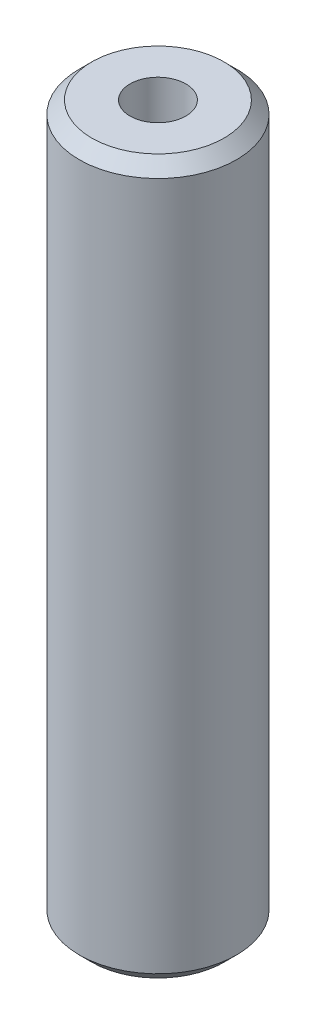
ISO-10303-21;
HEADER;
FILE_DESCRIPTION(('STEP AP214'),'2;1');
FILE_NAME('part.step','',(''),(''),'','','');
FILE_SCHEMA(('AUTOMOTIVE_DESIGN { 1 0 10303 214 1 1 1 1 }'));
ENDSEC;
DATA;
#1=APPLICATION_CONTEXT('core data for automotive mechanical design processes');
#2=APPLICATION_PROTOCOL_DEFINITION('international standard','automotive_design',2000,#1);
#3=PRODUCT_CONTEXT('',#1,'mechanical');
#4=PRODUCT('Part','Part','',(#3));
#5=PRODUCT_RELATED_PRODUCT_CATEGORY('part','',(#4));
#6=PRODUCT_DEFINITION_FORMATION('','',#4);
#7=PRODUCT_DEFINITION_CONTEXT('part definition',#1,'design');
#8=PRODUCT_DEFINITION('design','',#6,#7);
#9=PRODUCT_DEFINITION_SHAPE('','',#8);
#10=(LENGTH_UNIT() NAMED_UNIT(*) SI_UNIT(.MILLI.,.METRE.));
#11=(NAMED_UNIT(*) PLANE_ANGLE_UNIT() SI_UNIT($,.RADIAN.));
#12=(NAMED_UNIT(*) SI_UNIT($,.STERADIAN.) SOLID_ANGLE_UNIT());
#13=UNCERTAINTY_MEASURE_WITH_UNIT(LENGTH_MEASURE(1.E-05),#10,'distance_accuracy_value','');
#14=(GEOMETRIC_REPRESENTATION_CONTEXT(3) GLOBAL_UNCERTAINTY_ASSIGNED_CONTEXT((#13)) GLOBAL_UNIT_ASSIGNED_CONTEXT((#10,
#11,#12)) REPRESENTATION_CONTEXT('',''));
#15=CARTESIAN_POINT('',(0.,0.,0.));
#16=DIRECTION('',(0.,0.,1.));
#17=DIRECTION('',(1.,0.,0.));
#18=AXIS2_PLACEMENT_3D('',#15,#16,#17);
#19=CARTESIAN_POINT('',(0.,272.418557322986,0.));
#20=DIRECTION('',(0.,-1.,0.));
#21=DIRECTION('',(0.,0.,-1.));
#22=AXIS2_PLACEMENT_3D('',#19,#20,#21);
#23=CYLINDRICAL_SURFACE('',#22,30.);
#24=CARTESIAN_POINT('',(0.,267.654126208411,0.));
#25=DIRECTION('',(0.,1.,0.));
#26=DIRECTION('',(0.,0.,1.));
#27=AXIS2_PLACEMENT_3D('',#24,#25,#26);
#28=CIRCLE('',#27,30.);
#29=CARTESIAN_POINT('',(0.,267.654126208411,30.));
#30=VERTEX_POINT('',#29);
#31=EDGE_CURVE('E50',#30,#30,#28,.F.);
#32=ORIENTED_EDGE('',*,*,#31,.T.);
#33=EDGE_LOOP('',(#32));
#34=FACE_BOUND('',#33,.T.);
#35=CARTESIAN_POINT('',(0.,4.7644311145757,0.));
#36=DIRECTION('',(0.,1.,0.));
#37=DIRECTION('',(0.,0.,1.));
#38=AXIS2_PLACEMENT_3D('',#35,#36,#37);
#39=CIRCLE('',#38,30.);
#40=CARTESIAN_POINT('',(0.,4.7644311145757,30.));
#41=VERTEX_POINT('',#40);
#42=EDGE_CURVE('E51',#41,#41,#39,.T.);
#43=ORIENTED_EDGE('',*,*,#42,.T.);
#44=EDGE_LOOP('',(#43));
#45=FACE_BOUND('',#44,.T.);
#46=ADVANCED_FACE('F39',(#34,#45),#23,.T.);
#47=CARTESIAN_POINT('',(0.,272.418557322986,0.));
#48=DIRECTION('',(0.,1.,0.));
#49=DIRECTION('',(0.,0.,1.));
#50=AXIS2_PLACEMENT_3D('',#47,#48,#49);
#51=PLANE('',#50);
#52=CARTESIAN_POINT('',(0.,272.418557322986,0.));
#53=DIRECTION('',(0.,1.,0.));
#54=DIRECTION('',(0.,0.,1.));
#55=AXIS2_PLACEMENT_3D('',#52,#53,#54);
#56=CIRCLE('',#55,25.2355688854243);
#57=CARTESIAN_POINT('',(0.,272.418557322986,25.2355688854243));
#58=VERTEX_POINT('',#57);
#59=EDGE_CURVE('E54',#58,#58,#56,.T.);
#60=ORIENTED_EDGE('',*,*,#59,.T.);
#61=EDGE_LOOP('',(#60));
#62=FACE_BOUND('',#61,.T.);
#63=CARTESIAN_POINT('',(0.,272.418557322986,0.));
#64=DIRECTION('',(0.,1.,0.));
#65=DIRECTION('',(0.,0.,1.));
#66=AXIS2_PLACEMENT_3D('',#63,#64,#65);
#67=CIRCLE('',#66,10.6556857993642);
#68=CARTESIAN_POINT('',(0.,272.418557322986,10.6556857993642));
#69=VERTEX_POINT('',#68);
#70=EDGE_CURVE('E58',#69,#69,#67,.T.);
#71=ORIENTED_EDGE('',*,*,#70,.F.);
#72=EDGE_LOOP('',(#71));
#73=FACE_BOUND('',#72,.T.);
#74=ADVANCED_FACE('F69',(#62,#73),#51,.T.);
#75=CARTESIAN_POINT('',(0.,0.,0.));
#76=DIRECTION('',(0.,1.,0.));
#77=DIRECTION('',(0.,0.,1.));
#78=AXIS2_PLACEMENT_3D('',#75,#76,#77);
#79=PLANE('',#78);
#80=CARTESIAN_POINT('',(0.,0.,0.));
#81=DIRECTION('',(0.,1.,0.));
#82=DIRECTION('',(0.,0.,1.));
#83=AXIS2_PLACEMENT_3D('',#80,#81,#82);
#84=CIRCLE('',#83,25.2355688854243);
#85=CARTESIAN_POINT('',(0.,0.,25.2355688854243));
#86=VERTEX_POINT('',#85);
#87=EDGE_CURVE('E10',#86,#86,#84,.F.);
#88=ORIENTED_EDGE('',*,*,#87,.T.);
#89=EDGE_LOOP('',(#88));
#90=FACE_BOUND('',#89,.T.);
#91=CARTESIAN_POINT('',(0.,0.,0.));
#92=DIRECTION('',(0.,1.,0.));
#93=DIRECTION('',(0.,0.,1.));
#94=AXIS2_PLACEMENT_3D('',#91,#92,#93);
#95=CIRCLE('',#94,10.6556857993642);
#96=CARTESIAN_POINT('',(0.,0.,10.6556857993642));
#97=VERTEX_POINT('',#96);
#98=EDGE_CURVE('E63',#97,#97,#95,.T.);
#99=ORIENTED_EDGE('',*,*,#98,.T.);
#100=EDGE_LOOP('',(#99));
#101=FACE_BOUND('',#100,.T.);
#102=ADVANCED_FACE('F75',(#90,#101),#79,.F.);
#103=CARTESIAN_POINT('',(0.,272.418557322986,0.));
#104=DIRECTION('',(0.,-1.,0.));
#105=DIRECTION('',(0.,0.,-1.));
#106=AXIS2_PLACEMENT_3D('',#103,#104,#105);
#107=CYLINDRICAL_SURFACE('',#106,10.6556857993642);
#108=ORIENTED_EDGE('',*,*,#70,.T.);
#109=EDGE_LOOP('',(#108));
#110=FACE_BOUND('',#109,.T.);
#111=ORIENTED_EDGE('',*,*,#98,.F.);
#112=EDGE_LOOP('',(#111));
#113=FACE_BOUND('',#112,.T.);
#114=ADVANCED_FACE('F70',(#110,#113),#107,.F.);
#115=CARTESIAN_POINT('',(0.,272.418557322986,0.));
#116=DIRECTION('',(0.,-1.,0.));
#117=DIRECTION('',(0.,0.,-1.));
#118=AXIS2_PLACEMENT_3D('',#115,#116,#117);
#119=CONICAL_SURFACE('',#118,25.2355688854243,0.785398163397445);
#120=ORIENTED_EDGE('',*,*,#31,.F.);
#121=EDGE_LOOP('',(#120));
#122=FACE_BOUND('',#121,.T.);
#123=ORIENTED_EDGE('',*,*,#59,.F.);
#124=EDGE_LOOP('',(#123));
#125=FACE_BOUND('',#124,.T.);
#126=ADVANCED_FACE('F81',(#122,#125),#119,.T.);
#127=CARTESIAN_POINT('',(0.,4.7644311145757,0.));
#128=DIRECTION('',(0.,1.,0.));
#129=DIRECTION('',(0.,0.,1.));
#130=AXIS2_PLACEMENT_3D('',#127,#128,#129);
#131=CONICAL_SURFACE('',#130,30.,0.785398163397451);
#132=ORIENTED_EDGE('',*,*,#87,.F.);
#133=EDGE_LOOP('',(#132));
#134=FACE_BOUND('',#133,.T.);
#135=ORIENTED_EDGE('',*,*,#42,.F.);
#136=EDGE_LOOP('',(#135));
#137=FACE_BOUND('',#136,.T.);
#138=ADVANCED_FACE('F45',(#134,#137),#131,.T.);
#139=CLOSED_SHELL('',(#46,#74,#102,#114,#126,#138));
#140=MANIFOLD_SOLID_BREP('B2',#139);
#141=ADVANCED_BREP_SHAPE_REPRESENTATION('',(#18,#140),#14);
#142=SHAPE_DEFINITION_REPRESENTATION(#9,#141);
ENDSEC;
END-ISO-10303-21;
